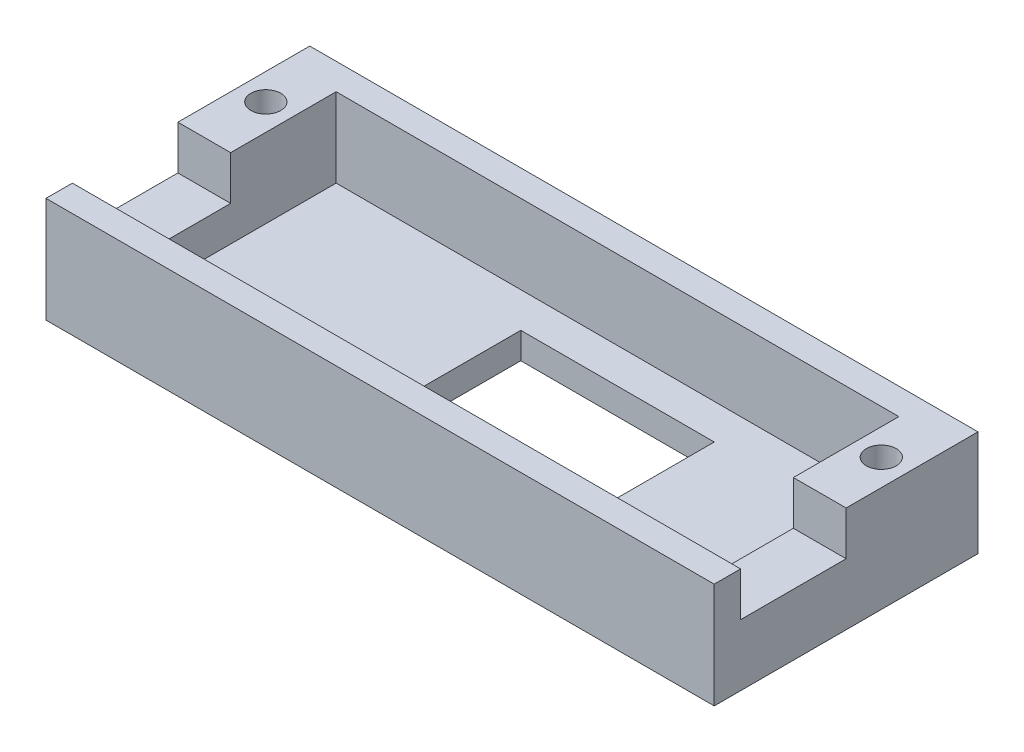
ISO-10303-21;
HEADER;
FILE_DESCRIPTION(('STEP AP214'),'2;1');
FILE_NAME('part.step','',(''),(''),'','','');
FILE_SCHEMA(('AUTOMOTIVE_DESIGN { 1 0 10303 214 1 1 1 1 }'));
ENDSEC;
DATA;
#1=APPLICATION_CONTEXT('core data for automotive mechanical design processes');
#2=APPLICATION_PROTOCOL_DEFINITION('international standard','automotive_design',2000,#1);
#3=PRODUCT_CONTEXT('',#1,'mechanical');
#4=PRODUCT('Part','Part','',(#3));
#5=PRODUCT_RELATED_PRODUCT_CATEGORY('part','',(#4));
#6=PRODUCT_DEFINITION_FORMATION('','',#4);
#7=PRODUCT_DEFINITION_CONTEXT('part definition',#1,'design');
#8=PRODUCT_DEFINITION('design','',#6,#7);
#9=PRODUCT_DEFINITION_SHAPE('','',#8);
#10=(LENGTH_UNIT() NAMED_UNIT(*) SI_UNIT(.MILLI.,.METRE.));
#11=(NAMED_UNIT(*) PLANE_ANGLE_UNIT() SI_UNIT($,.RADIAN.));
#12=(NAMED_UNIT(*) SI_UNIT($,.STERADIAN.) SOLID_ANGLE_UNIT());
#13=UNCERTAINTY_MEASURE_WITH_UNIT(LENGTH_MEASURE(1.E-05),#10,'distance_accuracy_value','');
#14=(GEOMETRIC_REPRESENTATION_CONTEXT(3) GLOBAL_UNCERTAINTY_ASSIGNED_CONTEXT((#13)) GLOBAL_UNIT_ASSIGNED_CONTEXT((#10,
#11,#12)) REPRESENTATION_CONTEXT('',''));
#15=CARTESIAN_POINT('',(0.,0.,0.));
#16=DIRECTION('',(0.,0.,1.));
#17=DIRECTION('',(1.,0.,0.));
#18=AXIS2_PLACEMENT_3D('',#15,#16,#17);
#19=CARTESIAN_POINT('',(0.,3.,0.));
#20=DIRECTION('',(0.,-1.,0.));
#21=DIRECTION('',(0.,0.,-1.));
#22=AXIS2_PLACEMENT_3D('',#19,#20,#21);
#23=PLANE('',#22);
#24=DIRECTION('',(0.,0.,1.));
#25=VECTOR('',#24,1.);
#26=CARTESIAN_POINT('',(31.,3.,-23.));
#27=LINE('',#26,#25);
#28=CARTESIAN_POINT('',(31.,3.,-23.));
#29=VERTEX_POINT('',#28);
#30=CARTESIAN_POINT('',(31.,3.,-3.));
#31=VERTEX_POINT('',#30);
#32=EDGE_CURVE('E179',#29,#31,#27,.T.);
#33=ORIENTED_EDGE('',*,*,#32,.F.);
#34=DIRECTION('',(-1.,0.,0.));
#35=VECTOR('',#34,1.);
#36=CARTESIAN_POINT('',(31.,3.,-23.));
#37=LINE('',#36,#35);
#38=CARTESIAN_POINT('',(53.,3.,-23.));
#39=VERTEX_POINT('',#38);
#40=EDGE_CURVE('E176',#39,#29,#37,.T.);
#41=ORIENTED_EDGE('',*,*,#40,.F.);
#42=DIRECTION('',(0.,0.,-1.));
#43=VECTOR('',#42,1.);
#44=CARTESIAN_POINT('',(53.,3.,-23.));
#45=LINE('',#44,#43);
#46=CARTESIAN_POINT('',(53.,3.,-3.));
#47=VERTEX_POINT('',#46);
#48=EDGE_CURVE('E55',#47,#39,#45,.T.);
#49=ORIENTED_EDGE('',*,*,#48,.F.);
#50=DIRECTION('',(1.,0.,0.));
#51=VECTOR('',#50,1.);
#52=CARTESIAN_POINT('',(6.,3.,-3.));
#53=LINE('',#52,#51);
#54=CARTESIAN_POINT('',(70.,3.,-3.));
#55=VERTEX_POINT('',#54);
#56=EDGE_CURVE('E193',#47,#55,#53,.T.);
#57=ORIENTED_EDGE('',*,*,#56,.T.);
#58=DIRECTION('',(0.,0.,-1.));
#59=VECTOR('',#58,1.);
#60=CARTESIAN_POINT('',(70.,3.,-3.));
#61=LINE('',#60,#59);
#62=CARTESIAN_POINT('',(70.,3.,-27.));
#63=VERTEX_POINT('',#62);
#64=EDGE_CURVE('E192',#55,#63,#61,.T.);
#65=ORIENTED_EDGE('',*,*,#64,.T.);
#66=DIRECTION('',(-1.,0.,0.));
#67=VECTOR('',#66,1.);
#68=CARTESIAN_POINT('',(6.,3.,-27.));
#69=LINE('',#68,#67);
#70=CARTESIAN_POINT('',(6.,3.,-27.));
#71=VERTEX_POINT('',#70);
#72=EDGE_CURVE('E198',#63,#71,#69,.T.);
#73=ORIENTED_EDGE('',*,*,#72,.T.);
#74=DIRECTION('',(0.,0.,1.));
#75=VECTOR('',#74,1.);
#76=CARTESIAN_POINT('',(6.,3.,-3.));
#77=LINE('',#76,#75);
#78=CARTESIAN_POINT('',(6.,3.,-3.));
#79=VERTEX_POINT('',#78);
#80=EDGE_CURVE('E190',#71,#79,#77,.T.);
#81=ORIENTED_EDGE('',*,*,#80,.T.);
#82=EDGE_CURVE('E169',#79,#31,#53,.T.);
#83=ORIENTED_EDGE('',*,*,#82,.T.);
#84=EDGE_LOOP('',(#33,#41,#49,#57,#65,#73,#81,#83));
#85=FACE_BOUND('',#84,.T.);
#86=ADVANCED_FACE('F39',(#85),#23,.F.);
#87=CARTESIAN_POINT('',(0.,12.,0.));
#88=DIRECTION('',(0.,-1.,0.));
#89=DIRECTION('',(0.,0.,-1.));
#90=AXIS2_PLACEMENT_3D('',#87,#88,#89);
#91=PLANE('',#90);
#92=CARTESIAN_POINT('',(3.,12.,-22.));
#93=DIRECTION('',(0.,1.,0.));
#94=DIRECTION('',(0.,0.,-1.));
#95=AXIS2_PLACEMENT_3D('',#92,#93,#94);
#96=CIRCLE('',#95,1.7);
#97=CARTESIAN_POINT('',(3.,12.,-23.7));
#98=VERTEX_POINT('',#97);
#99=EDGE_CURVE('E364',#98,#98,#96,.T.);
#100=ORIENTED_EDGE('',*,*,#99,.F.);
#101=EDGE_LOOP('',(#100));
#102=FACE_BOUND('',#101,.T.);
#103=CARTESIAN_POINT('',(73.,12.,-22.));
#104=DIRECTION('',(0.,1.,0.));
#105=DIRECTION('',(0.,0.,1.));
#106=AXIS2_PLACEMENT_3D('',#103,#104,#105);
#107=CIRCLE('',#106,1.70000000000001);
#108=CARTESIAN_POINT('',(73.,12.,-20.3));
#109=VERTEX_POINT('',#108);
#110=EDGE_CURVE('E283',#109,#109,#107,.T.);
#111=ORIENTED_EDGE('',*,*,#110,.F.);
#112=EDGE_LOOP('',(#111));
#113=FACE_BOUND('',#112,.T.);
#114=DIRECTION('',(0.,0.,-1.));
#115=VECTOR('',#114,1.);
#116=CARTESIAN_POINT('',(70.,12.,-3.));
#117=LINE('',#116,#115);
#118=CARTESIAN_POINT('',(70.,12.,-15.));
#119=VERTEX_POINT('',#118);
#120=CARTESIAN_POINT('',(70.,12.,-27.));
#121=VERTEX_POINT('',#120);
#122=EDGE_CURVE('E214',#119,#121,#117,.T.);
#123=ORIENTED_EDGE('',*,*,#122,.F.);
#124=DIRECTION('',(-1.,0.,0.));
#125=VECTOR('',#124,1.);
#126=CARTESIAN_POINT('',(70.,12.,-15.));
#127=LINE('',#126,#125);
#128=CARTESIAN_POINT('',(76.,12.,-15.));
#129=VERTEX_POINT('',#128);
#130=EDGE_CURVE('E343',#129,#119,#127,.T.);
#131=ORIENTED_EDGE('',*,*,#130,.F.);
#132=DIRECTION('',(0.,0.,-1.));
#133=VECTOR('',#132,1.);
#134=CARTESIAN_POINT('',(76.,12.,0.));
#135=LINE('',#134,#133);
#136=CARTESIAN_POINT('',(76.,12.,-30.));
#137=VERTEX_POINT('',#136);
#138=EDGE_CURVE('E243',#129,#137,#135,.T.);
#139=ORIENTED_EDGE('',*,*,#138,.T.);
#140=DIRECTION('',(-1.,0.,0.));
#141=VECTOR('',#140,1.);
#142=CARTESIAN_POINT('',(0.,12.,-30.));
#143=LINE('',#142,#141);
#144=CARTESIAN_POINT('',(0.,12.,-30.));
#145=VERTEX_POINT('',#144);
#146=EDGE_CURVE('E248',#137,#145,#143,.T.);
#147=ORIENTED_EDGE('',*,*,#146,.T.);
#148=DIRECTION('',(0.,0.,1.));
#149=VECTOR('',#148,1.);
#150=CARTESIAN_POINT('',(0.,12.,0.));
#151=LINE('',#150,#149);
#152=CARTESIAN_POINT('',(0.,12.,-15.));
#153=VERTEX_POINT('',#152);
#154=EDGE_CURVE('E235',#145,#153,#151,.T.);
#155=ORIENTED_EDGE('',*,*,#154,.T.);
#156=DIRECTION('',(-1.,0.,0.));
#157=VECTOR('',#156,1.);
#158=CARTESIAN_POINT('',(6.,12.,-15.));
#159=LINE('',#158,#157);
#160=CARTESIAN_POINT('',(6.,12.,-15.));
#161=VERTEX_POINT('',#160);
#162=EDGE_CURVE('E376',#161,#153,#159,.T.);
#163=ORIENTED_EDGE('',*,*,#162,.F.);
#164=DIRECTION('',(0.,0.,1.));
#165=VECTOR('',#164,1.);
#166=CARTESIAN_POINT('',(6.,12.,-3.));
#167=LINE('',#166,#165);
#168=CARTESIAN_POINT('',(6.,12.,-27.));
#169=VERTEX_POINT('',#168);
#170=EDGE_CURVE('E206',#169,#161,#167,.T.);
#171=ORIENTED_EDGE('',*,*,#170,.F.);
#172=DIRECTION('',(-1.,0.,0.));
#173=VECTOR('',#172,1.);
#174=CARTESIAN_POINT('',(6.,12.,-27.));
#175=LINE('',#174,#173);
#176=EDGE_CURVE('E217',#121,#169,#175,.T.);
#177=ORIENTED_EDGE('',*,*,#176,.F.);
#178=EDGE_LOOP('',(#123,#131,#139,#147,#155,#163,#171,#177));
#179=FACE_BOUND('',#178,.T.);
#180=ADVANCED_FACE('F342',(#102,#113,#179),#91,.F.);
#181=CARTESIAN_POINT('',(0.,12.,0.));
#182=DIRECTION('',(1.,0.,0.));
#183=DIRECTION('',(0.,0.,-1.));
#184=AXIS2_PLACEMENT_3D('',#181,#182,#183);
#185=PLANE('',#184);
#186=CARTESIAN_POINT('',(0.,12.,-3.));
#187=VERTEX_POINT('',#186);
#188=CARTESIAN_POINT('',(0.,12.,0.));
#189=VERTEX_POINT('',#188);
#190=EDGE_CURVE('E240',#187,#189,#151,.T.);
#191=ORIENTED_EDGE('',*,*,#190,.F.);
#192=DIRECTION('',(0.,1.,0.));
#193=VECTOR('',#192,1.);
#194=CARTESIAN_POINT('',(0.,7.,-3.));
#195=LINE('',#194,#193);
#196=CARTESIAN_POINT('',(0.,7.,-3.));
#197=VERTEX_POINT('',#196);
#198=EDGE_CURVE('E349',#197,#187,#195,.T.);
#199=ORIENTED_EDGE('',*,*,#198,.F.);
#200=DIRECTION('',(0.,0.,1.));
#201=VECTOR('',#200,1.);
#202=CARTESIAN_POINT('',(0.,7.,-3.));
#203=LINE('',#202,#201);
#204=CARTESIAN_POINT('',(0.,7.,-15.));
#205=VERTEX_POINT('',#204);
#206=EDGE_CURVE('E380',#205,#197,#203,.T.);
#207=ORIENTED_EDGE('',*,*,#206,.F.);
#208=DIRECTION('',(0.,1.,0.));
#209=VECTOR('',#208,1.);
#210=CARTESIAN_POINT('',(0.,7.,-15.));
#211=LINE('',#210,#209);
#212=EDGE_CURVE('E355',#205,#153,#211,.T.);
#213=ORIENTED_EDGE('',*,*,#212,.T.);
#214=ORIENTED_EDGE('',*,*,#154,.F.);
#215=DIRECTION('',(0.,-1.,0.));
#216=VECTOR('',#215,1.);
#217=CARTESIAN_POINT('',(0.,12.,-30.));
#218=LINE('',#217,#216);
#219=CARTESIAN_POINT('',(0.,0.,-30.));
#220=VERTEX_POINT('',#219);
#221=EDGE_CURVE('E251',#145,#220,#218,.T.);
#222=ORIENTED_EDGE('',*,*,#221,.T.);
#223=DIRECTION('',(0.,0.,1.));
#224=VECTOR('',#223,1.);
#225=CARTESIAN_POINT('',(0.,0.,0.));
#226=LINE('',#225,#224);
#227=CARTESIAN_POINT('',(0.,0.,0.));
#228=VERTEX_POINT('',#227);
#229=EDGE_CURVE('E224',#220,#228,#226,.T.);
#230=ORIENTED_EDGE('',*,*,#229,.T.);
#231=DIRECTION('',(0.,-1.,0.));
#232=VECTOR('',#231,1.);
#233=CARTESIAN_POINT('',(0.,12.,0.));
#234=LINE('',#233,#232);
#235=EDGE_CURVE('E275',#189,#228,#234,.T.);
#236=ORIENTED_EDGE('',*,*,#235,.F.);
#237=EDGE_LOOP('',(#191,#199,#207,#213,#214,#222,#230,#236));
#238=FACE_BOUND('',#237,.T.);
#239=ADVANCED_FACE('F41',(#238),#185,.F.);
#240=CARTESIAN_POINT('',(0.,12.,0.));
#241=DIRECTION('',(0.,0.,-1.));
#242=DIRECTION('',(-1.,0.,0.));
#243=AXIS2_PLACEMENT_3D('',#240,#241,#242);
#244=PLANE('',#243);
#245=DIRECTION('',(1.,0.,0.));
#246=VECTOR('',#245,1.);
#247=CARTESIAN_POINT('',(0.,0.,0.));
#248=LINE('',#247,#246);
#249=CARTESIAN_POINT('',(76.,0.,0.));
#250=VERTEX_POINT('',#249);
#251=EDGE_CURVE('E255',#228,#250,#248,.T.);
#252=ORIENTED_EDGE('',*,*,#251,.T.);
#253=DIRECTION('',(0.,-1.,0.));
#254=VECTOR('',#253,1.);
#255=CARTESIAN_POINT('',(76.,12.,0.));
#256=LINE('',#255,#254);
#257=CARTESIAN_POINT('',(76.,12.,0.));
#258=VERTEX_POINT('',#257);
#259=EDGE_CURVE('E271',#258,#250,#256,.T.);
#260=ORIENTED_EDGE('',*,*,#259,.F.);
#261=DIRECTION('',(1.,0.,0.));
#262=VECTOR('',#261,1.);
#263=CARTESIAN_POINT('',(0.,12.,0.));
#264=LINE('',#263,#262);
#265=EDGE_CURVE('E239',#189,#258,#264,.T.);
#266=ORIENTED_EDGE('',*,*,#265,.F.);
#267=ORIENTED_EDGE('',*,*,#235,.T.);
#268=EDGE_LOOP('',(#252,#260,#266,#267));
#269=FACE_BOUND('',#268,.T.);
#270=ADVANCED_FACE('F333',(#269),#244,.F.);
#271=CARTESIAN_POINT('',(76.,12.,0.));
#272=DIRECTION('',(-1.,0.,0.));
#273=DIRECTION('',(0.,0.,1.));
#274=AXIS2_PLACEMENT_3D('',#271,#272,#273);
#275=PLANE('',#274);
#276=ORIENTED_EDGE('',*,*,#138,.F.);
#277=DIRECTION('',(0.,1.,0.));
#278=VECTOR('',#277,1.);
#279=CARTESIAN_POINT('',(76.,7.,-15.));
#280=LINE('',#279,#278);
#281=CARTESIAN_POINT('',(76.,7.,-15.));
#282=VERTEX_POINT('',#281);
#283=EDGE_CURVE('E365',#282,#129,#280,.T.);
#284=ORIENTED_EDGE('',*,*,#283,.F.);
#285=DIRECTION('',(0.,0.,-1.));
#286=VECTOR('',#285,1.);
#287=CARTESIAN_POINT('',(76.,7.,-3.));
#288=LINE('',#287,#286);
#289=CARTESIAN_POINT('',(76.,7.,-3.));
#290=VERTEX_POINT('',#289);
#291=EDGE_CURVE('E600',#290,#282,#288,.T.);
#292=ORIENTED_EDGE('',*,*,#291,.F.);
#293=DIRECTION('',(0.,1.,0.));
#294=VECTOR('',#293,1.);
#295=CARTESIAN_POINT('',(76.,7.,-3.));
#296=LINE('',#295,#294);
#297=CARTESIAN_POINT('',(76.,12.,-3.));
#298=VERTEX_POINT('',#297);
#299=EDGE_CURVE('E368',#290,#298,#296,.T.);
#300=ORIENTED_EDGE('',*,*,#299,.T.);
#301=EDGE_CURVE('E244',#258,#298,#135,.T.);
#302=ORIENTED_EDGE('',*,*,#301,.F.);
#303=ORIENTED_EDGE('',*,*,#259,.T.);
#304=DIRECTION('',(0.,0.,-1.));
#305=VECTOR('',#304,1.);
#306=CARTESIAN_POINT('',(76.,0.,0.));
#307=LINE('',#306,#305);
#308=CARTESIAN_POINT('',(76.,0.,-30.));
#309=VERTEX_POINT('',#308);
#310=EDGE_CURVE('E258',#250,#309,#307,.T.);
#311=ORIENTED_EDGE('',*,*,#310,.T.);
#312=DIRECTION('',(0.,-1.,0.));
#313=VECTOR('',#312,1.);
#314=CARTESIAN_POINT('',(76.,12.,-30.));
#315=LINE('',#314,#313);
#316=EDGE_CURVE('E267',#137,#309,#315,.T.);
#317=ORIENTED_EDGE('',*,*,#316,.F.);
#318=EDGE_LOOP('',(#276,#284,#292,#300,#302,#303,#311,#317));
#319=FACE_BOUND('',#318,.T.);
#320=ADVANCED_FACE('F326',(#319),#275,.F.);
#321=CARTESIAN_POINT('',(0.,12.,-30.));
#322=DIRECTION('',(0.,0.,1.));
#323=DIRECTION('',(1.,0.,0.));
#324=AXIS2_PLACEMENT_3D('',#321,#322,#323);
#325=PLANE('',#324);
#326=DIRECTION('',(-1.,0.,0.));
#327=VECTOR('',#326,1.);
#328=CARTESIAN_POINT('',(0.,0.,-30.));
#329=LINE('',#328,#327);
#330=EDGE_CURVE('E261',#309,#220,#329,.T.);
#331=ORIENTED_EDGE('',*,*,#330,.T.);
#332=ORIENTED_EDGE('',*,*,#221,.F.);
#333=ORIENTED_EDGE('',*,*,#146,.F.);
#334=ORIENTED_EDGE('',*,*,#316,.T.);
#335=EDGE_LOOP('',(#331,#332,#333,#334));
#336=FACE_BOUND('',#335,.T.);
#337=ADVANCED_FACE('F322',(#336),#325,.F.);
#338=ORIENTED_EDGE('',*,*,#301,.T.);
#339=DIRECTION('',(1.,0.,0.));
#340=VECTOR('',#339,1.);
#341=CARTESIAN_POINT('',(6.,12.,-3.));
#342=LINE('',#341,#340);
#343=EDGE_CURVE('E210',#187,#298,#342,.T.);
#344=ORIENTED_EDGE('',*,*,#343,.F.);
#345=ORIENTED_EDGE('',*,*,#190,.T.);
#346=ORIENTED_EDGE('',*,*,#265,.T.);
#347=EDGE_LOOP('',(#338,#344,#345,#346));
#348=FACE_BOUND('',#347,.T.);
#349=ADVANCED_FACE('F305',(#348),#91,.F.);
#350=CARTESIAN_POINT('',(0.,0.,0.));
#351=DIRECTION('',(0.,-1.,0.));
#352=DIRECTION('',(0.,0.,-1.));
#353=AXIS2_PLACEMENT_3D('',#350,#351,#352);
#354=PLANE('',#353);
#355=DIRECTION('',(0.,0.,-1.));
#356=VECTOR('',#355,1.);
#357=CARTESIAN_POINT('',(31.,0.,0.));
#358=LINE('',#357,#356);
#359=CARTESIAN_POINT('',(31.,0.,-3.));
#360=VERTEX_POINT('',#359);
#361=CARTESIAN_POINT('',(31.,0.,-23.));
#362=VERTEX_POINT('',#361);
#363=EDGE_CURVE('E11',#360,#362,#358,.T.);
#364=ORIENTED_EDGE('',*,*,#363,.F.);
#365=DIRECTION('',(-1.,0.,0.));
#366=VECTOR('',#365,1.);
#367=CARTESIAN_POINT('',(0.,0.,-3.));
#368=LINE('',#367,#366);
#369=CARTESIAN_POINT('',(53.,0.,-3.));
#370=VERTEX_POINT('',#369);
#371=EDGE_CURVE('E172',#370,#360,#368,.T.);
#372=ORIENTED_EDGE('',*,*,#371,.F.);
#373=DIRECTION('',(0.,0.,1.));
#374=VECTOR('',#373,1.);
#375=CARTESIAN_POINT('',(53.,0.,0.));
#376=LINE('',#375,#374);
#377=CARTESIAN_POINT('',(53.,0.,-23.));
#378=VERTEX_POINT('',#377);
#379=EDGE_CURVE('E289',#378,#370,#376,.T.);
#380=ORIENTED_EDGE('',*,*,#379,.F.);
#381=DIRECTION('',(1.,0.,0.));
#382=VECTOR('',#381,1.);
#383=CARTESIAN_POINT('',(0.,0.,-23.));
#384=LINE('',#383,#382);
#385=EDGE_CURVE('E48',#362,#378,#384,.T.);
#386=ORIENTED_EDGE('',*,*,#385,.F.);
#387=EDGE_LOOP('',(#364,#372,#380,#386));
#388=FACE_BOUND('',#387,.T.);
#389=CARTESIAN_POINT('',(73.,0.,-22.));
#390=DIRECTION('',(0.,-1.,0.));
#391=DIRECTION('',(0.,0.,-1.));
#392=AXIS2_PLACEMENT_3D('',#389,#390,#391);
#393=CIRCLE('',#392,1.70000000000001);
#394=CARTESIAN_POINT('',(73.,0.,-23.7));
#395=VERTEX_POINT('',#394);
#396=EDGE_CURVE('E211',#395,#395,#393,.T.);
#397=ORIENTED_EDGE('',*,*,#396,.F.);
#398=EDGE_LOOP('',(#397));
#399=FACE_BOUND('',#398,.T.);
#400=CARTESIAN_POINT('',(3.,0.,-22.));
#401=DIRECTION('',(0.,-1.,0.));
#402=DIRECTION('',(0.,0.,-1.));
#403=AXIS2_PLACEMENT_3D('',#400,#401,#402);
#404=CIRCLE('',#403,1.7);
#405=CARTESIAN_POINT('',(3.,0.,-23.7));
#406=VERTEX_POINT('',#405);
#407=EDGE_CURVE('E279',#406,#406,#404,.T.);
#408=ORIENTED_EDGE('',*,*,#407,.F.);
#409=EDGE_LOOP('',(#408));
#410=FACE_BOUND('',#409,.T.);
#411=ORIENTED_EDGE('',*,*,#229,.F.);
#412=ORIENTED_EDGE('',*,*,#330,.F.);
#413=ORIENTED_EDGE('',*,*,#310,.F.);
#414=ORIENTED_EDGE('',*,*,#251,.F.);
#415=EDGE_LOOP('',(#411,#412,#413,#414));
#416=FACE_BOUND('',#415,.T.);
#417=ADVANCED_FACE('F301',(#388,#399,#410,#416),#354,.T.);
#418=CARTESIAN_POINT('',(6.,3.,-3.));
#419=DIRECTION('',(-1.,0.,0.));
#420=DIRECTION('',(0.,0.,1.));
#421=AXIS2_PLACEMENT_3D('',#418,#419,#420);
#422=PLANE('',#421);
#423=ORIENTED_EDGE('',*,*,#170,.T.);
#424=DIRECTION('',(0.,1.,0.));
#425=VECTOR('',#424,1.);
#426=CARTESIAN_POINT('',(6.,7.,-15.));
#427=LINE('',#426,#425);
#428=CARTESIAN_POINT('',(6.,7.,-15.));
#429=VERTEX_POINT('',#428);
#430=EDGE_CURVE('E386',#429,#161,#427,.T.);
#431=ORIENTED_EDGE('',*,*,#430,.F.);
#432=DIRECTION('',(0.,0.,-1.));
#433=VECTOR('',#432,1.);
#434=CARTESIAN_POINT('',(6.,7.,-3.));
#435=LINE('',#434,#433);
#436=CARTESIAN_POINT('',(6.,7.,-3.));
#437=VERTEX_POINT('',#436);
#438=EDGE_CURVE('E371',#437,#429,#435,.T.);
#439=ORIENTED_EDGE('',*,*,#438,.F.);
#440=DIRECTION('',(0.,1.,0.));
#441=VECTOR('',#440,1.);
#442=CARTESIAN_POINT('',(6.,3.,-3.));
#443=LINE('',#442,#441);
#444=EDGE_CURVE('E205',#79,#437,#443,.T.);
#445=ORIENTED_EDGE('',*,*,#444,.F.);
#446=ORIENTED_EDGE('',*,*,#80,.F.);
#447=DIRECTION('',(0.,1.,0.));
#448=VECTOR('',#447,1.);
#449=CARTESIAN_POINT('',(6.,3.,-27.));
#450=LINE('',#449,#448);
#451=EDGE_CURVE('E221',#71,#169,#450,.T.);
#452=ORIENTED_EDGE('',*,*,#451,.T.);
#453=EDGE_LOOP('',(#423,#431,#439,#445,#446,#452));
#454=FACE_BOUND('',#453,.T.);
#455=ADVANCED_FACE('F304',(#454),#422,.F.);
#456=CARTESIAN_POINT('',(6.,3.,-27.));
#457=DIRECTION('',(0.,0.,-1.));
#458=DIRECTION('',(-1.,0.,0.));
#459=AXIS2_PLACEMENT_3D('',#456,#457,#458);
#460=PLANE('',#459);
#461=ORIENTED_EDGE('',*,*,#176,.T.);
#462=ORIENTED_EDGE('',*,*,#451,.F.);
#463=ORIENTED_EDGE('',*,*,#72,.F.);
#464=DIRECTION('',(0.,1.,0.));
#465=VECTOR('',#464,1.);
#466=CARTESIAN_POINT('',(70.,3.,-27.));
#467=LINE('',#466,#465);
#468=EDGE_CURVE('E225',#63,#121,#467,.T.);
#469=ORIENTED_EDGE('',*,*,#468,.T.);
#470=EDGE_LOOP('',(#461,#462,#463,#469));
#471=FACE_BOUND('',#470,.T.);
#472=ADVANCED_FACE('F425',(#471),#460,.F.);
#473=CARTESIAN_POINT('',(70.,3.,-3.));
#474=DIRECTION('',(1.,0.,0.));
#475=DIRECTION('',(0.,0.,-1.));
#476=AXIS2_PLACEMENT_3D('',#473,#474,#475);
#477=PLANE('',#476);
#478=DIRECTION('',(0.,0.,1.));
#479=VECTOR('',#478,1.);
#480=CARTESIAN_POINT('',(70.,7.,-3.));
#481=LINE('',#480,#479);
#482=CARTESIAN_POINT('',(70.,7.,-15.));
#483=VERTEX_POINT('',#482);
#484=CARTESIAN_POINT('',(70.,7.,-3.));
#485=VERTEX_POINT('',#484);
#486=EDGE_CURVE('E348',#483,#485,#481,.T.);
#487=ORIENTED_EDGE('',*,*,#486,.F.);
#488=DIRECTION('',(0.,1.,0.));
#489=VECTOR('',#488,1.);
#490=CARTESIAN_POINT('',(70.,7.,-15.));
#491=LINE('',#490,#489);
#492=EDGE_CURVE('E361',#483,#119,#491,.T.);
#493=ORIENTED_EDGE('',*,*,#492,.T.);
#494=ORIENTED_EDGE('',*,*,#122,.T.);
#495=ORIENTED_EDGE('',*,*,#468,.F.);
#496=ORIENTED_EDGE('',*,*,#64,.F.);
#497=DIRECTION('',(0.,1.,0.));
#498=VECTOR('',#497,1.);
#499=CARTESIAN_POINT('',(70.,3.,-3.));
#500=LINE('',#499,#498);
#501=EDGE_CURVE('E229',#55,#485,#500,.T.);
#502=ORIENTED_EDGE('',*,*,#501,.T.);
#503=EDGE_LOOP('',(#487,#493,#494,#495,#496,#502));
#504=FACE_BOUND('',#503,.T.);
#505=ADVANCED_FACE('F428',(#504),#477,.F.);
#506=CARTESIAN_POINT('',(6.,3.,-3.));
#507=DIRECTION('',(0.,0.,1.));
#508=DIRECTION('',(1.,0.,0.));
#509=AXIS2_PLACEMENT_3D('',#506,#507,#508);
#510=PLANE('',#509);
#511=ORIENTED_EDGE('',*,*,#343,.T.);
#512=ORIENTED_EDGE('',*,*,#299,.F.);
#513=DIRECTION('',(1.,0.,0.));
#514=VECTOR('',#513,1.);
#515=CARTESIAN_POINT('',(70.,7.,-3.));
#516=LINE('',#515,#514);
#517=EDGE_CURVE('E353',#485,#290,#516,.T.);
#518=ORIENTED_EDGE('',*,*,#517,.F.);
#519=ORIENTED_EDGE('',*,*,#501,.F.);
#520=ORIENTED_EDGE('',*,*,#56,.F.);
#521=DIRECTION('',(0.,1.,0.));
#522=VECTOR('',#521,1.);
#523=CARTESIAN_POINT('',(53.,-2.,-3.));
#524=LINE('',#523,#522);
#525=EDGE_CURVE('E62',#370,#47,#524,.T.);
#526=ORIENTED_EDGE('',*,*,#525,.F.);
#527=ORIENTED_EDGE('',*,*,#371,.T.);
#528=DIRECTION('',(0.,1.,0.));
#529=VECTOR('',#528,1.);
#530=CARTESIAN_POINT('',(31.,-2.,-3.));
#531=LINE('',#530,#529);
#532=EDGE_CURVE('E164',#360,#31,#531,.T.);
#533=ORIENTED_EDGE('',*,*,#532,.T.);
#534=ORIENTED_EDGE('',*,*,#82,.F.);
#535=ORIENTED_EDGE('',*,*,#444,.T.);
#536=DIRECTION('',(1.,0.,0.));
#537=VECTOR('',#536,1.);
#538=CARTESIAN_POINT('',(6.,7.,-3.));
#539=LINE('',#538,#537);
#540=EDGE_CURVE('E383',#197,#437,#539,.T.);
#541=ORIENTED_EDGE('',*,*,#540,.F.);
#542=ORIENTED_EDGE('',*,*,#198,.T.);
#543=EDGE_LOOP('',(#511,#512,#518,#519,#520,#526,#527,#533,#534,#535,#541,#542));
#544=FACE_BOUND('',#543,.T.);
#545=ADVANCED_FACE('F166',(#544),#510,.F.);
#546=CARTESIAN_POINT('',(3.,-8.,-22.));
#547=DIRECTION('',(0.,1.,0.));
#548=DIRECTION('',(0.,0.,1.));
#549=AXIS2_PLACEMENT_3D('',#546,#547,#548);
#550=CYLINDRICAL_SURFACE('',#549,1.7);
#551=ORIENTED_EDGE('',*,*,#407,.T.);
#552=EDGE_LOOP('',(#551));
#553=FACE_BOUND('',#552,.T.);
#554=ORIENTED_EDGE('',*,*,#99,.T.);
#555=EDGE_LOOP('',(#554));
#556=FACE_BOUND('',#555,.T.);
#557=ADVANCED_FACE('F399',(#553,#556),#550,.F.);
#558=CARTESIAN_POINT('',(73.,-8.,-22.));
#559=DIRECTION('',(0.,1.,0.));
#560=DIRECTION('',(0.,0.,1.));
#561=AXIS2_PLACEMENT_3D('',#558,#559,#560);
#562=CYLINDRICAL_SURFACE('',#561,1.70000000000001);
#563=ORIENTED_EDGE('',*,*,#396,.T.);
#564=EDGE_LOOP('',(#563));
#565=FACE_BOUND('',#564,.T.);
#566=ORIENTED_EDGE('',*,*,#110,.T.);
#567=EDGE_LOOP('',(#566));
#568=FACE_BOUND('',#567,.T.);
#569=ADVANCED_FACE('F406',(#565,#568),#562,.F.);
#570=CARTESIAN_POINT('',(6.,7.,-15.));
#571=DIRECTION('',(0.,0.,-1.));
#572=DIRECTION('',(-1.,0.,0.));
#573=AXIS2_PLACEMENT_3D('',#570,#571,#572);
#574=PLANE('',#573);
#575=ORIENTED_EDGE('',*,*,#162,.T.);
#576=ORIENTED_EDGE('',*,*,#212,.F.);
#577=DIRECTION('',(-1.,0.,0.));
#578=VECTOR('',#577,1.);
#579=CARTESIAN_POINT('',(6.,7.,-15.));
#580=LINE('',#579,#578);
#581=EDGE_CURVE('E375',#429,#205,#580,.T.);
#582=ORIENTED_EDGE('',*,*,#581,.F.);
#583=ORIENTED_EDGE('',*,*,#430,.T.);
#584=EDGE_LOOP('',(#575,#576,#582,#583));
#585=FACE_BOUND('',#584,.T.);
#586=ADVANCED_FACE('F408',(#585),#574,.F.);
#587=CARTESIAN_POINT('',(0.,7.,0.));
#588=DIRECTION('',(0.,1.,0.));
#589=DIRECTION('',(0.,0.,1.));
#590=AXIS2_PLACEMENT_3D('',#587,#588,#589);
#591=PLANE('',#590);
#592=ORIENTED_EDGE('',*,*,#438,.T.);
#593=ORIENTED_EDGE('',*,*,#581,.T.);
#594=ORIENTED_EDGE('',*,*,#206,.T.);
#595=ORIENTED_EDGE('',*,*,#540,.T.);
#596=EDGE_LOOP('',(#592,#593,#594,#595));
#597=FACE_BOUND('',#596,.T.);
#598=ADVANCED_FACE('F415',(#597),#591,.T.);
#599=CARTESIAN_POINT('',(70.,7.,-15.));
#600=DIRECTION('',(0.,0.,-1.));
#601=DIRECTION('',(-1.,0.,0.));
#602=AXIS2_PLACEMENT_3D('',#599,#600,#601);
#603=PLANE('',#602);
#604=ORIENTED_EDGE('',*,*,#130,.T.);
#605=ORIENTED_EDGE('',*,*,#492,.F.);
#606=DIRECTION('',(-1.,0.,0.));
#607=VECTOR('',#606,1.);
#608=CARTESIAN_POINT('',(70.,7.,-15.));
#609=LINE('',#608,#607);
#610=EDGE_CURVE('E359',#282,#483,#609,.T.);
#611=ORIENTED_EDGE('',*,*,#610,.F.);
#612=ORIENTED_EDGE('',*,*,#283,.T.);
#613=EDGE_LOOP('',(#604,#605,#611,#612));
#614=FACE_BOUND('',#613,.T.);
#615=ADVANCED_FACE('F523',(#614),#603,.F.);
#616=CARTESIAN_POINT('',(0.,7.,0.));
#617=DIRECTION('',(0.,-1.,0.));
#618=DIRECTION('',(0.,0.,-1.));
#619=AXIS2_PLACEMENT_3D('',#616,#617,#618);
#620=PLANE('',#619);
#621=ORIENTED_EDGE('',*,*,#486,.T.);
#622=ORIENTED_EDGE('',*,*,#517,.T.);
#623=ORIENTED_EDGE('',*,*,#291,.T.);
#624=ORIENTED_EDGE('',*,*,#610,.T.);
#625=EDGE_LOOP('',(#621,#622,#623,#624));
#626=FACE_BOUND('',#625,.T.);
#627=ADVANCED_FACE('F533',(#626),#620,.F.);
#628=CARTESIAN_POINT('',(31.,-2.,-23.));
#629=DIRECTION('',(-1.,0.,0.));
#630=DIRECTION('',(0.,0.,1.));
#631=AXIS2_PLACEMENT_3D('',#628,#629,#630);
#632=PLANE('',#631);
#633=ORIENTED_EDGE('',*,*,#363,.T.);
#634=DIRECTION('',(0.,1.,0.));
#635=VECTOR('',#634,1.);
#636=CARTESIAN_POINT('',(31.,-2.,-23.));
#637=LINE('',#636,#635);
#638=EDGE_CURVE('E182',#362,#29,#637,.T.);
#639=ORIENTED_EDGE('',*,*,#638,.T.);
#640=ORIENTED_EDGE('',*,*,#32,.T.);
#641=ORIENTED_EDGE('',*,*,#532,.F.);
#642=EDGE_LOOP('',(#633,#639,#640,#641));
#643=FACE_BOUND('',#642,.T.);
#644=ADVANCED_FACE('F180',(#643),#632,.F.);
#645=CARTESIAN_POINT('',(31.,-2.,-23.));
#646=DIRECTION('',(0.,0.,-1.));
#647=DIRECTION('',(-1.,0.,0.));
#648=AXIS2_PLACEMENT_3D('',#645,#646,#647);
#649=PLANE('',#648);
#650=ORIENTED_EDGE('',*,*,#385,.T.);
#651=DIRECTION('',(0.,1.,0.));
#652=VECTOR('',#651,1.);
#653=CARTESIAN_POINT('',(53.,-2.,-23.));
#654=LINE('',#653,#652);
#655=EDGE_CURVE('E295',#378,#39,#654,.T.);
#656=ORIENTED_EDGE('',*,*,#655,.T.);
#657=ORIENTED_EDGE('',*,*,#40,.T.);
#658=ORIENTED_EDGE('',*,*,#638,.F.);
#659=EDGE_LOOP('',(#650,#656,#657,#658));
#660=FACE_BOUND('',#659,.T.);
#661=ADVANCED_FACE('F294',(#660),#649,.F.);
#662=CARTESIAN_POINT('',(53.,-2.,-23.));
#663=DIRECTION('',(1.,0.,0.));
#664=DIRECTION('',(0.,0.,-1.));
#665=AXIS2_PLACEMENT_3D('',#662,#663,#664);
#666=PLANE('',#665);
#667=ORIENTED_EDGE('',*,*,#379,.T.);
#668=ORIENTED_EDGE('',*,*,#525,.T.);
#669=ORIENTED_EDGE('',*,*,#48,.T.);
#670=ORIENTED_EDGE('',*,*,#655,.F.);
#671=EDGE_LOOP('',(#667,#668,#669,#670));
#672=FACE_BOUND('',#671,.T.);
#673=ADVANCED_FACE('F298',(#672),#666,.F.);
#674=CLOSED_SHELL('',(#86,#180,#239,#270,#320,#337,#349,#417,#455,#472,#505,#545,#557,#569,#586,
#598,#615,#627,#644,#661,#673));
#675=MANIFOLD_SOLID_BREP('B2',#674);
#676=ADVANCED_BREP_SHAPE_REPRESENTATION('',(#18,#675),#14);
#677=SHAPE_DEFINITION_REPRESENTATION(#9,#676);
ENDSEC;
END-ISO-10303-21;
